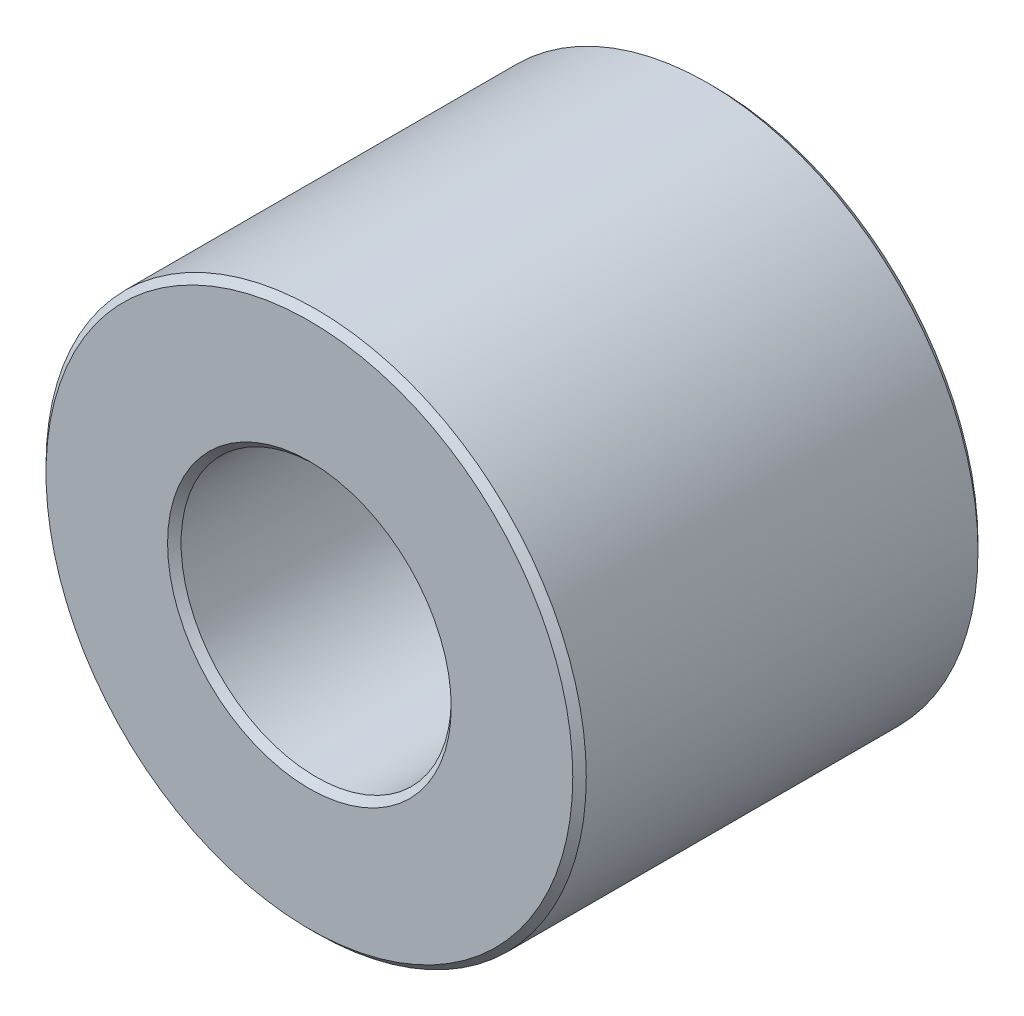
ISO-10303-21;
HEADER;
FILE_DESCRIPTION(('STEP AP214'),'2;1');
FILE_NAME('part.step','',(''),(''),'','','');
FILE_SCHEMA(('AUTOMOTIVE_DESIGN { 1 0 10303 214 1 1 1 1 }'));
ENDSEC;
DATA;
#1=APPLICATION_CONTEXT('core data for automotive mechanical design processes');
#2=APPLICATION_PROTOCOL_DEFINITION('international standard','automotive_design',2000,#1);
#3=PRODUCT_CONTEXT('',#1,'mechanical');
#4=PRODUCT('Part','Part','',(#3));
#5=PRODUCT_RELATED_PRODUCT_CATEGORY('part','',(#4));
#6=PRODUCT_DEFINITION_FORMATION('','',#4);
#7=PRODUCT_DEFINITION_CONTEXT('part definition',#1,'design');
#8=PRODUCT_DEFINITION('design','',#6,#7);
#9=PRODUCT_DEFINITION_SHAPE('','',#8);
#10=(LENGTH_UNIT() NAMED_UNIT(*) SI_UNIT(.MILLI.,.METRE.));
#11=(NAMED_UNIT(*) PLANE_ANGLE_UNIT() SI_UNIT($,.RADIAN.));
#12=(NAMED_UNIT(*) SI_UNIT($,.STERADIAN.) SOLID_ANGLE_UNIT());
#13=UNCERTAINTY_MEASURE_WITH_UNIT(LENGTH_MEASURE(1.E-05),#10,'distance_accuracy_value','');
#14=(GEOMETRIC_REPRESENTATION_CONTEXT(3) GLOBAL_UNCERTAINTY_ASSIGNED_CONTEXT((#13)) GLOBAL_UNIT_ASSIGNED_CONTEXT((#10,
#11,#12)) REPRESENTATION_CONTEXT('',''));
#15=CARTESIAN_POINT('',(0.,0.,0.));
#16=DIRECTION('',(0.,0.,1.));
#17=DIRECTION('',(1.,0.,0.));
#18=AXIS2_PLACEMENT_3D('',#15,#16,#17);
#19=CARTESIAN_POINT('',(0.,0.,6.));
#20=DIRECTION('',(0.,0.,1.));
#21=DIRECTION('',(1.,0.,0.));
#22=AXIS2_PLACEMENT_3D('',#19,#20,#21);
#23=PLANE('',#22);
#24=CARTESIAN_POINT('',(0.,0.,6.));
#25=DIRECTION('',(0.,0.,1.));
#26=DIRECTION('',(1.,0.,0.));
#27=AXIS2_PLACEMENT_3D('',#24,#25,#26);
#28=CIRCLE('',#27,3.9);
#29=CARTESIAN_POINT('',(3.9,0.,6.));
#30=VERTEX_POINT('',#29);
#31=EDGE_CURVE('E10',#30,#30,#28,.T.);
#32=ORIENTED_EDGE('',*,*,#31,.T.);
#33=EDGE_LOOP('',(#32));
#34=FACE_BOUND('',#33,.T.);
#35=CARTESIAN_POINT('',(0.,0.,6.));
#36=DIRECTION('',(0.,0.,1.));
#37=DIRECTION('',(1.,0.,0.));
#38=AXIS2_PLACEMENT_3D('',#35,#36,#37);
#39=CIRCLE('',#38,2.1);
#40=CARTESIAN_POINT('',(2.1,0.,6.));
#41=VERTEX_POINT('',#40);
#42=EDGE_CURVE('E39',#41,#41,#39,.F.);
#43=ORIENTED_EDGE('',*,*,#42,.T.);
#44=EDGE_LOOP('',(#43));
#45=FACE_BOUND('',#44,.T.);
#46=ADVANCED_FACE('F32',(#34,#45),#23,.T.);
#47=CARTESIAN_POINT('',(0.,0.,0.));
#48=DIRECTION('',(0.,0.,1.));
#49=DIRECTION('',(1.,0.,0.));
#50=AXIS2_PLACEMENT_3D('',#47,#48,#49);
#51=PLANE('',#50);
#52=CARTESIAN_POINT('',(0.,0.,0.));
#53=DIRECTION('',(0.,0.,1.));
#54=DIRECTION('',(1.,0.,0.));
#55=AXIS2_PLACEMENT_3D('',#52,#53,#54);
#56=CIRCLE('',#55,2.1);
#57=CARTESIAN_POINT('',(2.1,0.,0.));
#58=VERTEX_POINT('',#57);
#59=EDGE_CURVE('E58',#58,#58,#56,.T.);
#60=ORIENTED_EDGE('',*,*,#59,.T.);
#61=EDGE_LOOP('',(#60));
#62=FACE_BOUND('',#61,.T.);
#63=CARTESIAN_POINT('',(0.,0.,0.));
#64=DIRECTION('',(0.,0.,1.));
#65=DIRECTION('',(1.,0.,0.));
#66=AXIS2_PLACEMENT_3D('',#63,#64,#65);
#67=CIRCLE('',#66,3.9);
#68=CARTESIAN_POINT('',(3.9,0.,0.));
#69=VERTEX_POINT('',#68);
#70=EDGE_CURVE('E61',#69,#69,#67,.F.);
#71=ORIENTED_EDGE('',*,*,#70,.T.);
#72=EDGE_LOOP('',(#71));
#73=FACE_BOUND('',#72,.T.);
#74=ADVANCED_FACE('F65',(#62,#73),#51,.F.);
#75=CARTESIAN_POINT('',(0.,0.,6.));
#76=DIRECTION('',(0.,0.,-1.));
#77=DIRECTION('',(-1.,0.,0.));
#78=AXIS2_PLACEMENT_3D('',#75,#76,#77);
#79=CYLINDRICAL_SURFACE('',#78,4.);
#80=CARTESIAN_POINT('',(0.,0.,0.0999999999999985));
#81=DIRECTION('',(0.,0.,1.));
#82=DIRECTION('',(1.,0.,0.));
#83=AXIS2_PLACEMENT_3D('',#80,#81,#82);
#84=CIRCLE('',#83,4.);
#85=CARTESIAN_POINT('',(4.,0.,0.0999999999999985));
#86=VERTEX_POINT('',#85);
#87=EDGE_CURVE('E43',#86,#86,#84,.T.);
#88=ORIENTED_EDGE('',*,*,#87,.T.);
#89=EDGE_LOOP('',(#88));
#90=FACE_BOUND('',#89,.T.);
#91=CARTESIAN_POINT('',(0.,0.,5.9));
#92=DIRECTION('',(0.,0.,1.));
#93=DIRECTION('',(1.,0.,0.));
#94=AXIS2_PLACEMENT_3D('',#91,#92,#93);
#95=CIRCLE('',#94,4.);
#96=CARTESIAN_POINT('',(4.,0.,5.9));
#97=VERTEX_POINT('',#96);
#98=EDGE_CURVE('E47',#97,#97,#95,.F.);
#99=ORIENTED_EDGE('',*,*,#98,.T.);
#100=EDGE_LOOP('',(#99));
#101=FACE_BOUND('',#100,.T.);
#102=ADVANCED_FACE('F75',(#90,#101),#79,.T.);
#103=CARTESIAN_POINT('',(0.,0.,6.));
#104=DIRECTION('',(0.,0.,-1.));
#105=DIRECTION('',(-1.,0.,0.));
#106=AXIS2_PLACEMENT_3D('',#103,#104,#105);
#107=CYLINDRICAL_SURFACE('',#106,2.);
#108=CARTESIAN_POINT('',(0.,0.,0.0999999999999994));
#109=DIRECTION('',(0.,0.,1.));
#110=DIRECTION('',(1.,0.,0.));
#111=AXIS2_PLACEMENT_3D('',#108,#109,#110);
#112=CIRCLE('',#111,2.);
#113=CARTESIAN_POINT('',(2.,0.,0.0999999999999994));
#114=VERTEX_POINT('',#113);
#115=EDGE_CURVE('E52',#114,#114,#112,.F.);
#116=ORIENTED_EDGE('',*,*,#115,.T.);
#117=EDGE_LOOP('',(#116));
#118=FACE_BOUND('',#117,.T.);
#119=CARTESIAN_POINT('',(0.,0.,5.9));
#120=DIRECTION('',(0.,0.,1.));
#121=DIRECTION('',(1.,0.,0.));
#122=AXIS2_PLACEMENT_3D('',#119,#120,#121);
#123=CIRCLE('',#122,2.);
#124=CARTESIAN_POINT('',(2.,0.,5.9));
#125=VERTEX_POINT('',#124);
#126=EDGE_CURVE('E55',#125,#125,#123,.T.);
#127=ORIENTED_EDGE('',*,*,#126,.T.);
#128=EDGE_LOOP('',(#127));
#129=FACE_BOUND('',#128,.T.);
#130=ADVANCED_FACE('F78',(#118,#129),#107,.F.);
#131=CARTESIAN_POINT('',(0.,0.,0.));
#132=DIRECTION('',(0.,0.,-1.));
#133=DIRECTION('',(-1.,0.,0.));
#134=AXIS2_PLACEMENT_3D('',#131,#132,#133);
#135=CONICAL_SURFACE('',#134,2.1,0.785398163397444);
#136=ORIENTED_EDGE('',*,*,#115,.F.);
#137=EDGE_LOOP('',(#136));
#138=FACE_BOUND('',#137,.T.);
#139=ORIENTED_EDGE('',*,*,#59,.F.);
#140=EDGE_LOOP('',(#139));
#141=FACE_BOUND('',#140,.T.);
#142=ADVANCED_FACE('F71',(#138,#141),#135,.F.);
#143=CARTESIAN_POINT('',(0.,0.,0.0999999999999985));
#144=DIRECTION('',(0.,0.,1.));
#145=DIRECTION('',(1.,0.,0.));
#146=AXIS2_PLACEMENT_3D('',#143,#144,#145);
#147=CONICAL_SURFACE('',#146,4.,0.785398163397453);
#148=ORIENTED_EDGE('',*,*,#70,.F.);
#149=EDGE_LOOP('',(#148));
#150=FACE_BOUND('',#149,.T.);
#151=ORIENTED_EDGE('',*,*,#87,.F.);
#152=EDGE_LOOP('',(#151));
#153=FACE_BOUND('',#152,.T.);
#154=ADVANCED_FACE('F67',(#150,#153),#147,.T.);
#155=CARTESIAN_POINT('',(0.,0.,6.));
#156=DIRECTION('',(0.,0.,-1.));
#157=DIRECTION('',(-1.,0.,0.));
#158=AXIS2_PLACEMENT_3D('',#155,#156,#157);
#159=CONICAL_SURFACE('',#158,3.9,0.785398163397461);
#160=ORIENTED_EDGE('',*,*,#98,.F.);
#161=EDGE_LOOP('',(#160));
#162=FACE_BOUND('',#161,.T.);
#163=ORIENTED_EDGE('',*,*,#31,.F.);
#164=EDGE_LOOP('',(#163));
#165=FACE_BOUND('',#164,.T.);
#166=ADVANCED_FACE('F70',(#162,#165),#159,.T.);
#167=CARTESIAN_POINT('',(0.,0.,5.9));
#168=DIRECTION('',(0.,0.,1.));
#169=DIRECTION('',(1.,0.,0.));
#170=AXIS2_PLACEMENT_3D('',#167,#168,#169);
#171=CONICAL_SURFACE('',#170,2.,0.785398163397448);
#172=ORIENTED_EDGE('',*,*,#42,.F.);
#173=EDGE_LOOP('',(#172));
#174=FACE_BOUND('',#173,.T.);
#175=ORIENTED_EDGE('',*,*,#126,.F.);
#176=EDGE_LOOP('',(#175));
#177=FACE_BOUND('',#176,.T.);
#178=ADVANCED_FACE('F34',(#174,#177),#171,.F.);
#179=CLOSED_SHELL('',(#46,#74,#102,#130,#142,#154,#166,#178));
#180=MANIFOLD_SOLID_BREP('B2',#179);
#181=ADVANCED_BREP_SHAPE_REPRESENTATION('',(#18,#180),#14);
#182=SHAPE_DEFINITION_REPRESENTATION(#9,#181);
ENDSEC;
END-ISO-10303-21;
